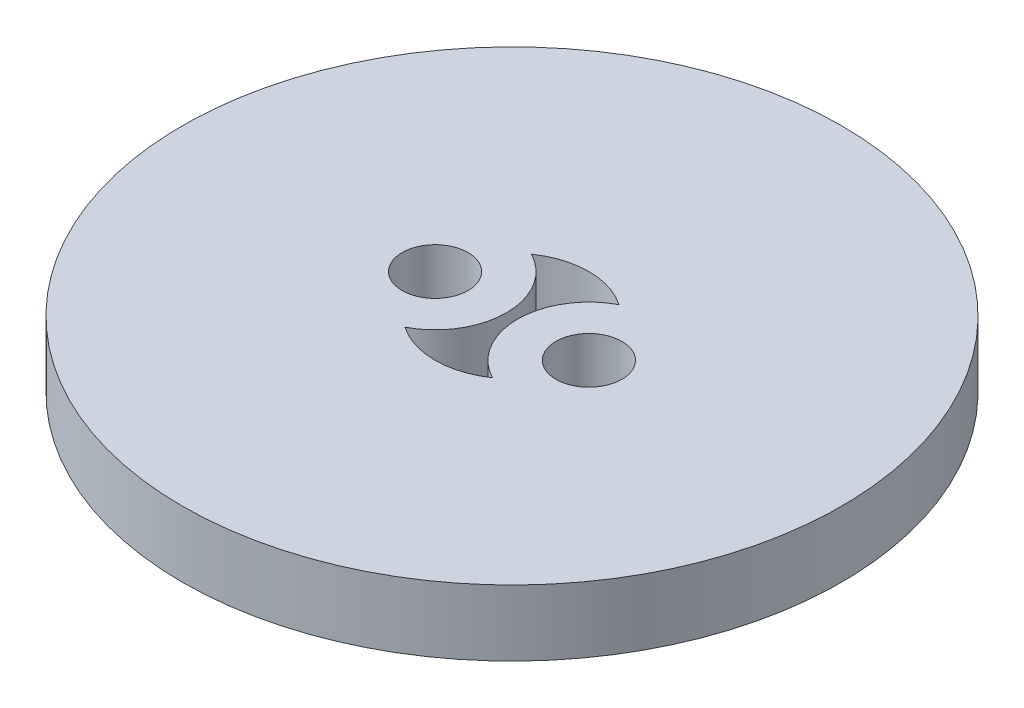
ISO-10303-21;
HEADER;
FILE_DESCRIPTION(('STEP AP214'),'2;1');
FILE_NAME('part.step','',(''),(''),'','','');
FILE_SCHEMA(('AUTOMOTIVE_DESIGN { 1 0 10303 214 1 1 1 1 }'));
ENDSEC;
DATA;
#1=APPLICATION_CONTEXT('core data for automotive mechanical design processes');
#2=APPLICATION_PROTOCOL_DEFINITION('international standard','automotive_design',2000,#1);
#3=PRODUCT_CONTEXT('',#1,'mechanical');
#4=PRODUCT('Part','Part','',(#3));
#5=PRODUCT_RELATED_PRODUCT_CATEGORY('part','',(#4));
#6=PRODUCT_DEFINITION_FORMATION('','',#4);
#7=PRODUCT_DEFINITION_CONTEXT('part definition',#1,'design');
#8=PRODUCT_DEFINITION('design','',#6,#7);
#9=PRODUCT_DEFINITION_SHAPE('','',#8);
#10=(LENGTH_UNIT() NAMED_UNIT(*) SI_UNIT(.MILLI.,.METRE.));
#11=(NAMED_UNIT(*) PLANE_ANGLE_UNIT() SI_UNIT($,.RADIAN.));
#12=(NAMED_UNIT(*) SI_UNIT($,.STERADIAN.) SOLID_ANGLE_UNIT());
#13=UNCERTAINTY_MEASURE_WITH_UNIT(LENGTH_MEASURE(1.E-05),#10,'distance_accuracy_value','');
#14=(GEOMETRIC_REPRESENTATION_CONTEXT(3) GLOBAL_UNCERTAINTY_ASSIGNED_CONTEXT((#13)) GLOBAL_UNIT_ASSIGNED_CONTEXT((#10,
#11,#12)) REPRESENTATION_CONTEXT('',''));
#15=CARTESIAN_POINT('',(0.,0.,0.));
#16=DIRECTION('',(0.,0.,1.));
#17=DIRECTION('',(1.,0.,0.));
#18=AXIS2_PLACEMENT_3D('',#15,#16,#17);
#19=CARTESIAN_POINT('',(0.,3.,0.));
#20=DIRECTION('',(0.,1.,0.));
#21=DIRECTION('',(0.,0.,1.));
#22=AXIS2_PLACEMENT_3D('',#19,#20,#21);
#23=PLANE('',#22);
#24=CARTESIAN_POINT('',(-3.5,3.,0.));
#25=DIRECTION('',(0.,1.,0.));
#26=DIRECTION('',(0.,0.,1.));
#27=AXIS2_PLACEMENT_3D('',#24,#25,#26);
#28=CIRCLE('',#27,1.5);
#29=CARTESIAN_POINT('',(-3.5,3.,1.5));
#30=VERTEX_POINT('',#29);
#31=EDGE_CURVE('E116',#30,#30,#28,.T.);
#32=ORIENTED_EDGE('',*,*,#31,.F.);
#33=EDGE_LOOP('',(#32));
#34=FACE_BOUND('',#33,.T.);
#35=CARTESIAN_POINT('',(0.,3.,0.));
#36=DIRECTION('',(0.,1.,0.));
#37=DIRECTION('',(0.,0.,1.));
#38=AXIS2_PLACEMENT_3D('',#35,#36,#37);
#39=CIRCLE('',#38,15.);
#40=CARTESIAN_POINT('',(0.,3.,15.));
#41=VERTEX_POINT('',#40);
#42=EDGE_CURVE('E11',#41,#41,#39,.T.);
#43=ORIENTED_EDGE('',*,*,#42,.T.);
#44=EDGE_LOOP('',(#43));
#45=FACE_BOUND('',#44,.T.);
#46=CARTESIAN_POINT('',(3.5,3.,0.));
#47=DIRECTION('',(0.,1.,0.));
#48=DIRECTION('',(0.,0.,1.));
#49=AXIS2_PLACEMENT_3D('',#46,#47,#48);
#50=CIRCLE('',#49,1.5);
#51=CARTESIAN_POINT('',(3.5,3.,1.5));
#52=VERTEX_POINT('',#51);
#53=EDGE_CURVE('E110',#52,#52,#50,.T.);
#54=ORIENTED_EDGE('',*,*,#53,.F.);
#55=EDGE_LOOP('',(#54));
#56=FACE_BOUND('',#55,.T.);
#57=CARTESIAN_POINT('',(-3.5,3.,0.));
#58=DIRECTION('',(0.,-1.,0.));
#59=DIRECTION('',(0.,0.,1.));
#60=AXIS2_PLACEMENT_3D('',#57,#58,#59);
#61=CIRCLE('',#60,3.25);
#62=CARTESIAN_POINT('',(-1.99107142857143,3.,-2.87847782105865));
#63=VERTEX_POINT('',#62);
#64=CARTESIAN_POINT('',(-1.99107142857143,3.,2.87847782105865));
#65=VERTEX_POINT('',#64);
#66=EDGE_CURVE('E82',#63,#65,#61,.T.);
#67=ORIENTED_EDGE('',*,*,#66,.F.);
#68=CARTESIAN_POINT('',(0.,3.,0.));
#69=DIRECTION('',(0.,1.,0.));
#70=DIRECTION('',(0.,0.,1.));
#71=AXIS2_PLACEMENT_3D('',#68,#69,#70);
#72=CIRCLE('',#71,3.5);
#73=CARTESIAN_POINT('',(1.99107142857143,3.,-2.87847782105865));
#74=VERTEX_POINT('',#73);
#75=EDGE_CURVE('E74',#74,#63,#72,.T.);
#76=ORIENTED_EDGE('',*,*,#75,.F.);
#77=CARTESIAN_POINT('',(3.5,3.,0.));
#78=DIRECTION('',(0.,-1.,0.));
#79=DIRECTION('',(0.,0.,1.));
#80=AXIS2_PLACEMENT_3D('',#77,#78,#79);
#81=CIRCLE('',#80,3.25);
#82=CARTESIAN_POINT('',(1.99107142857143,3.,2.87847782105865));
#83=VERTEX_POINT('',#82);
#84=EDGE_CURVE('E96',#83,#74,#81,.T.);
#85=ORIENTED_EDGE('',*,*,#84,.F.);
#86=CARTESIAN_POINT('',(0.,3.,0.));
#87=DIRECTION('',(0.,1.,0.));
#88=DIRECTION('',(0.,0.,1.));
#89=AXIS2_PLACEMENT_3D('',#86,#87,#88);
#90=CIRCLE('',#89,3.5);
#91=EDGE_CURVE('E94',#65,#83,#90,.T.);
#92=ORIENTED_EDGE('',*,*,#91,.F.);
#93=EDGE_LOOP('',(#67,#76,#85,#92));
#94=FACE_BOUND('',#93,.T.);
#95=ADVANCED_FACE('F33',(#34,#45,#56,#94),#23,.T.);
#96=CARTESIAN_POINT('',(0.,0.,0.));
#97=DIRECTION('',(0.,1.,0.));
#98=DIRECTION('',(0.,0.,1.));
#99=AXIS2_PLACEMENT_3D('',#96,#97,#98);
#100=PLANE('',#99);
#101=CARTESIAN_POINT('',(3.5,0.,0.));
#102=DIRECTION('',(0.,1.,0.));
#103=DIRECTION('',(0.,0.,1.));
#104=AXIS2_PLACEMENT_3D('',#101,#102,#103);
#105=CIRCLE('',#104,1.5);
#106=CARTESIAN_POINT('',(3.5,0.,1.5));
#107=VERTEX_POINT('',#106);
#108=EDGE_CURVE('E90',#107,#107,#105,.T.);
#109=ORIENTED_EDGE('',*,*,#108,.T.);
#110=EDGE_LOOP('',(#109));
#111=FACE_BOUND('',#110,.T.);
#112=CARTESIAN_POINT('',(-3.5,0.,0.));
#113=DIRECTION('',(0.,1.,0.));
#114=DIRECTION('',(0.,0.,1.));
#115=AXIS2_PLACEMENT_3D('',#112,#113,#114);
#116=CIRCLE('',#115,1.5);
#117=CARTESIAN_POINT('',(-3.5,0.,1.5));
#118=VERTEX_POINT('',#117);
#119=EDGE_CURVE('E113',#118,#118,#116,.T.);
#120=ORIENTED_EDGE('',*,*,#119,.T.);
#121=EDGE_LOOP('',(#120));
#122=FACE_BOUND('',#121,.T.);
#123=CARTESIAN_POINT('',(0.,0.,0.));
#124=DIRECTION('',(0.,1.,0.));
#125=DIRECTION('',(0.,0.,1.));
#126=AXIS2_PLACEMENT_3D('',#123,#124,#125);
#127=CIRCLE('',#126,15.);
#128=CARTESIAN_POINT('',(0.,0.,15.));
#129=VERTEX_POINT('',#128);
#130=EDGE_CURVE('E37',#129,#129,#127,.T.);
#131=ORIENTED_EDGE('',*,*,#130,.F.);
#132=EDGE_LOOP('',(#131));
#133=FACE_BOUND('',#132,.T.);
#134=CARTESIAN_POINT('',(0.,0.,0.));
#135=DIRECTION('',(0.,1.,0.));
#136=DIRECTION('',(0.,0.,1.));
#137=AXIS2_PLACEMENT_3D('',#134,#135,#136);
#138=CIRCLE('',#137,3.5);
#139=CARTESIAN_POINT('',(1.99107142857143,0.,-2.87847782105865));
#140=VERTEX_POINT('',#139);
#141=CARTESIAN_POINT('',(-1.99107142857143,0.,-2.87847782105865));
#142=VERTEX_POINT('',#141);
#143=EDGE_CURVE('E56',#140,#142,#138,.T.);
#144=ORIENTED_EDGE('',*,*,#143,.T.);
#145=CARTESIAN_POINT('',(-3.5,0.,0.));
#146=DIRECTION('',(0.,-1.,0.));
#147=DIRECTION('',(0.,0.,1.));
#148=AXIS2_PLACEMENT_3D('',#145,#146,#147);
#149=CIRCLE('',#148,3.25);
#150=CARTESIAN_POINT('',(-1.99107142857143,0.,2.87847782105865));
#151=VERTEX_POINT('',#150);
#152=EDGE_CURVE('E89',#142,#151,#149,.T.);
#153=ORIENTED_EDGE('',*,*,#152,.T.);
#154=CARTESIAN_POINT('',(0.,0.,0.));
#155=DIRECTION('',(0.,1.,0.));
#156=DIRECTION('',(0.,0.,1.));
#157=AXIS2_PLACEMENT_3D('',#154,#155,#156);
#158=CIRCLE('',#157,3.5);
#159=CARTESIAN_POINT('',(1.99107142857143,0.,2.87847782105865));
#160=VERTEX_POINT('',#159);
#161=EDGE_CURVE('E102',#151,#160,#158,.T.);
#162=ORIENTED_EDGE('',*,*,#161,.T.);
#163=CARTESIAN_POINT('',(3.5,0.,0.));
#164=DIRECTION('',(0.,-1.,0.));
#165=DIRECTION('',(0.,0.,1.));
#166=AXIS2_PLACEMENT_3D('',#163,#164,#165);
#167=CIRCLE('',#166,3.25);
#168=EDGE_CURVE('E83',#160,#140,#167,.T.);
#169=ORIENTED_EDGE('',*,*,#168,.T.);
#170=EDGE_LOOP('',(#144,#153,#162,#169));
#171=FACE_BOUND('',#170,.T.);
#172=ADVANCED_FACE('F122',(#111,#122,#133,#171),#100,.F.);
#173=CARTESIAN_POINT('',(0.,3.,0.));
#174=DIRECTION('',(0.,-1.,0.));
#175=DIRECTION('',(0.,0.,-1.));
#176=AXIS2_PLACEMENT_3D('',#173,#174,#175);
#177=CYLINDRICAL_SURFACE('',#176,15.);
#178=ORIENTED_EDGE('',*,*,#42,.F.);
#179=EDGE_LOOP('',(#178));
#180=FACE_BOUND('',#179,.T.);
#181=ORIENTED_EDGE('',*,*,#130,.T.);
#182=EDGE_LOOP('',(#181));
#183=FACE_BOUND('',#182,.T.);
#184=ADVANCED_FACE('F35',(#180,#183),#177,.T.);
#185=CARTESIAN_POINT('',(-3.5,3.,0.));
#186=DIRECTION('',(0.,-1.,0.));
#187=DIRECTION('',(0.,0.,-1.));
#188=AXIS2_PLACEMENT_3D('',#185,#186,#187);
#189=CYLINDRICAL_SURFACE('',#188,1.5);
#190=ORIENTED_EDGE('',*,*,#31,.T.);
#191=EDGE_LOOP('',(#190));
#192=FACE_BOUND('',#191,.T.);
#193=ORIENTED_EDGE('',*,*,#119,.F.);
#194=EDGE_LOOP('',(#193));
#195=FACE_BOUND('',#194,.T.);
#196=ADVANCED_FACE('F125',(#192,#195),#189,.F.);
#197=CARTESIAN_POINT('',(3.5,3.,0.));
#198=DIRECTION('',(0.,-1.,0.));
#199=DIRECTION('',(0.,0.,-1.));
#200=AXIS2_PLACEMENT_3D('',#197,#198,#199);
#201=CYLINDRICAL_SURFACE('',#200,1.5);
#202=ORIENTED_EDGE('',*,*,#53,.T.);
#203=EDGE_LOOP('',(#202));
#204=FACE_BOUND('',#203,.T.);
#205=ORIENTED_EDGE('',*,*,#108,.F.);
#206=EDGE_LOOP('',(#205));
#207=FACE_BOUND('',#206,.T.);
#208=ADVANCED_FACE('F127',(#204,#207),#201,.F.);
#209=CARTESIAN_POINT('',(0.,3.,0.));
#210=DIRECTION('',(0.,-1.,0.));
#211=DIRECTION('',(0.,0.,-1.));
#212=AXIS2_PLACEMENT_3D('',#209,#210,#211);
#213=CYLINDRICAL_SURFACE('',#212,3.5);
#214=ORIENTED_EDGE('',*,*,#143,.F.);
#215=DIRECTION('',(0.,-1.,0.));
#216=VECTOR('',#215,1.);
#217=CARTESIAN_POINT('',(1.99107142857143,3.,-2.87847782105865));
#218=LINE('',#217,#216);
#219=EDGE_CURVE('E78',#74,#140,#218,.T.);
#220=ORIENTED_EDGE('',*,*,#219,.F.);
#221=ORIENTED_EDGE('',*,*,#75,.T.);
#222=DIRECTION('',(0.,-1.,0.));
#223=VECTOR('',#222,1.);
#224=CARTESIAN_POINT('',(-1.99107142857143,3.,-2.87847782105865));
#225=LINE('',#224,#223);
#226=EDGE_CURVE('E77',#63,#142,#225,.T.);
#227=ORIENTED_EDGE('',*,*,#226,.T.);
#228=EDGE_LOOP('',(#214,#220,#221,#227));
#229=FACE_BOUND('',#228,.T.);
#230=ADVANCED_FACE('F76',(#229),#213,.F.);
#231=CARTESIAN_POINT('',(-3.5,3.,0.));
#232=DIRECTION('',(0.,-1.,0.));
#233=DIRECTION('',(0.,0.,-1.));
#234=AXIS2_PLACEMENT_3D('',#231,#232,#233);
#235=CYLINDRICAL_SURFACE('',#234,3.25);
#236=ORIENTED_EDGE('',*,*,#152,.F.);
#237=ORIENTED_EDGE('',*,*,#226,.F.);
#238=ORIENTED_EDGE('',*,*,#66,.T.);
#239=DIRECTION('',(0.,-1.,0.));
#240=VECTOR('',#239,1.);
#241=CARTESIAN_POINT('',(-1.99107142857143,3.,2.87847782105865));
#242=LINE('',#241,#240);
#243=EDGE_CURVE('E91',#65,#151,#242,.T.);
#244=ORIENTED_EDGE('',*,*,#243,.T.);
#245=EDGE_LOOP('',(#236,#237,#238,#244));
#246=FACE_BOUND('',#245,.T.);
#247=ADVANCED_FACE('F86',(#246),#235,.T.);
#248=CARTESIAN_POINT('',(0.,3.,0.));
#249=DIRECTION('',(0.,-1.,0.));
#250=DIRECTION('',(0.,0.,-1.));
#251=AXIS2_PLACEMENT_3D('',#248,#249,#250);
#252=CYLINDRICAL_SURFACE('',#251,3.5);
#253=ORIENTED_EDGE('',*,*,#161,.F.);
#254=ORIENTED_EDGE('',*,*,#243,.F.);
#255=ORIENTED_EDGE('',*,*,#91,.T.);
#256=DIRECTION('',(0.,-1.,0.));
#257=VECTOR('',#256,1.);
#258=CARTESIAN_POINT('',(1.99107142857143,3.,2.87847782105865));
#259=LINE('',#258,#257);
#260=EDGE_CURVE('E48',#83,#160,#259,.T.);
#261=ORIENTED_EDGE('',*,*,#260,.T.);
#262=EDGE_LOOP('',(#253,#254,#255,#261));
#263=FACE_BOUND('',#262,.T.);
#264=ADVANCED_FACE('F158',(#263),#252,.F.);
#265=CARTESIAN_POINT('',(3.5,3.,0.));
#266=DIRECTION('',(0.,-1.,0.));
#267=DIRECTION('',(0.,0.,-1.));
#268=AXIS2_PLACEMENT_3D('',#265,#266,#267);
#269=CYLINDRICAL_SURFACE('',#268,3.25);
#270=ORIENTED_EDGE('',*,*,#168,.F.);
#271=ORIENTED_EDGE('',*,*,#260,.F.);
#272=ORIENTED_EDGE('',*,*,#84,.T.);
#273=ORIENTED_EDGE('',*,*,#219,.T.);
#274=EDGE_LOOP('',(#270,#271,#272,#273));
#275=FACE_BOUND('',#274,.T.);
#276=ADVANCED_FACE('F156',(#275),#269,.T.);
#277=CLOSED_SHELL('',(#95,#172,#184,#196,#208,#230,#247,#264,#276));
#278=MANIFOLD_SOLID_BREP('B2',#277);
#279=ADVANCED_BREP_SHAPE_REPRESENTATION('',(#18,#278),#14);
#280=SHAPE_DEFINITION_REPRESENTATION(#9,#279);
ENDSEC;
END-ISO-10303-21;
